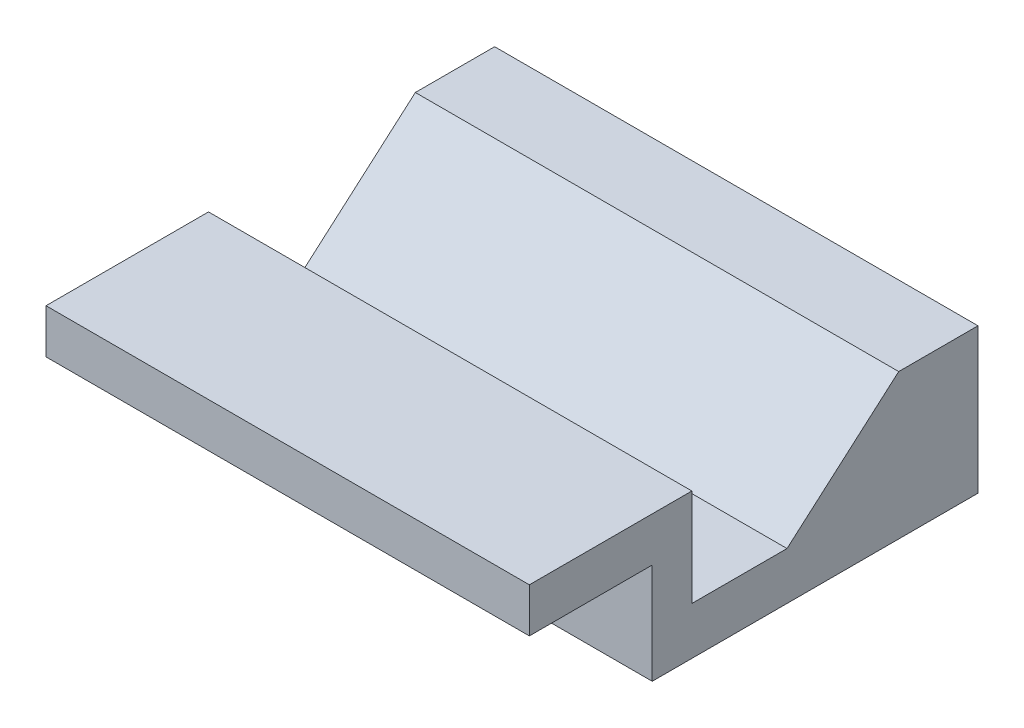
ISO-10303-21;
HEADER;
FILE_DESCRIPTION(('STEP AP214'),'2;1');
FILE_NAME('part.step','',(''),(''),'','','');
FILE_SCHEMA(('AUTOMOTIVE_DESIGN { 1 0 10303 214 1 1 1 1 }'));
ENDSEC;
DATA;
#1=APPLICATION_CONTEXT('core data for automotive mechanical design processes');
#2=APPLICATION_PROTOCOL_DEFINITION('international standard','automotive_design',2000,#1);
#3=PRODUCT_CONTEXT('',#1,'mechanical');
#4=PRODUCT('Part','Part','',(#3));
#5=PRODUCT_RELATED_PRODUCT_CATEGORY('part','',(#4));
#6=PRODUCT_DEFINITION_FORMATION('','',#4);
#7=PRODUCT_DEFINITION_CONTEXT('part definition',#1,'design');
#8=PRODUCT_DEFINITION('design','',#6,#7);
#9=PRODUCT_DEFINITION_SHAPE('','',#8);
#10=(LENGTH_UNIT() NAMED_UNIT(*) SI_UNIT(.MILLI.,.METRE.));
#11=(NAMED_UNIT(*) PLANE_ANGLE_UNIT() SI_UNIT($,.RADIAN.));
#12=(NAMED_UNIT(*) SI_UNIT($,.STERADIAN.) SOLID_ANGLE_UNIT());
#13=UNCERTAINTY_MEASURE_WITH_UNIT(LENGTH_MEASURE(1.E-05),#10,'distance_accuracy_value','');
#14=(GEOMETRIC_REPRESENTATION_CONTEXT(3) GLOBAL_UNCERTAINTY_ASSIGNED_CONTEXT((#13)) GLOBAL_UNIT_ASSIGNED_CONTEXT((#10,
#11,#12)) REPRESENTATION_CONTEXT('',''));
#15=CARTESIAN_POINT('',(0.,0.,0.));
#16=DIRECTION('',(0.,0.,1.));
#17=DIRECTION('',(1.,0.,0.));
#18=AXIS2_PLACEMENT_3D('',#15,#16,#17);
#19=CARTESIAN_POINT('',(30.48,0.,-10.247));
#20=DIRECTION('',(0.,0.,1.));
#21=DIRECTION('',(1.,0.,0.));
#22=AXIS2_PLACEMENT_3D('',#19,#20,#21);
#23=PLANE('',#22);
#24=DIRECTION('',(0.,1.,0.));
#25=VECTOR('',#24,1.);
#26=CARTESIAN_POINT('',(0.,0.,-10.247));
#27=LINE('',#26,#25);
#28=CARTESIAN_POINT('',(0.,-6.144,-10.247));
#29=VERTEX_POINT('',#28);
#30=CARTESIAN_POINT('',(0.,0.,-10.247));
#31=VERTEX_POINT('',#30);
#32=EDGE_CURVE('E141',#29,#31,#27,.T.);
#33=ORIENTED_EDGE('',*,*,#32,.T.);
#34=DIRECTION('',(-1.,0.,0.));
#35=VECTOR('',#34,1.);
#36=CARTESIAN_POINT('',(30.48,0.,-10.247));
#37=LINE('',#36,#35);
#38=CARTESIAN_POINT('',(30.48,0.,-10.247));
#39=VERTEX_POINT('',#38);
#40=EDGE_CURVE('E11',#39,#31,#37,.T.);
#41=ORIENTED_EDGE('',*,*,#40,.F.);
#42=DIRECTION('',(0.,1.,0.));
#43=VECTOR('',#42,1.);
#44=CARTESIAN_POINT('',(30.48,0.,-10.247));
#45=LINE('',#44,#43);
#46=CARTESIAN_POINT('',(30.48,-6.144,-10.247));
#47=VERTEX_POINT('',#46);
#48=EDGE_CURVE('E159',#47,#39,#45,.T.);
#49=ORIENTED_EDGE('',*,*,#48,.F.);
#50=DIRECTION('',(-1.,0.,0.));
#51=VECTOR('',#50,1.);
#52=CARTESIAN_POINT('',(30.48,-6.144,-10.247));
#53=LINE('',#52,#51);
#54=EDGE_CURVE('E137',#47,#29,#53,.T.);
#55=ORIENTED_EDGE('',*,*,#54,.T.);
#56=EDGE_LOOP('',(#33,#41,#49,#55));
#57=FACE_BOUND('',#56,.T.);
#58=ADVANCED_FACE('F33',(#57),#23,.F.);
#59=CARTESIAN_POINT('',(30.48,0.,0.));
#60=DIRECTION('',(0.,-1.,0.));
#61=DIRECTION('',(0.,0.,-1.));
#62=AXIS2_PLACEMENT_3D('',#59,#60,#61);
#63=PLANE('',#62);
#64=DIRECTION('',(0.,0.,1.));
#65=VECTOR('',#64,1.);
#66=CARTESIAN_POINT('',(0.,0.,0.));
#67=LINE('',#66,#65);
#68=CARTESIAN_POINT('',(0.,0.,0.));
#69=VERTEX_POINT('',#68);
#70=EDGE_CURVE('E144',#31,#69,#67,.T.);
#71=ORIENTED_EDGE('',*,*,#70,.T.);
#72=DIRECTION('',(-1.,0.,0.));
#73=VECTOR('',#72,1.);
#74=CARTESIAN_POINT('',(30.48,0.,0.));
#75=LINE('',#74,#73);
#76=CARTESIAN_POINT('',(30.48,0.,0.));
#77=VERTEX_POINT('',#76);
#78=EDGE_CURVE('E41',#77,#69,#75,.T.);
#79=ORIENTED_EDGE('',*,*,#78,.F.);
#80=DIRECTION('',(0.,0.,1.));
#81=VECTOR('',#80,1.);
#82=CARTESIAN_POINT('',(30.48,0.,0.));
#83=LINE('',#82,#81);
#84=EDGE_CURVE('E98',#39,#77,#83,.T.);
#85=ORIENTED_EDGE('',*,*,#84,.F.);
#86=ORIENTED_EDGE('',*,*,#40,.T.);
#87=EDGE_LOOP('',(#71,#79,#85,#86));
#88=FACE_BOUND('',#87,.T.);
#89=ADVANCED_FACE('F208',(#88),#63,.F.);
#90=CARTESIAN_POINT('',(30.48,0.,0.));
#91=DIRECTION('',(0.,0.,-1.));
#92=DIRECTION('',(0.,1.,0.));
#93=AXIS2_PLACEMENT_3D('',#90,#91,#92);
#94=PLANE('',#93);
#95=DIRECTION('',(0.,-1.,0.));
#96=VECTOR('',#95,1.);
#97=CARTESIAN_POINT('',(0.,0.,0.));
#98=LINE('',#97,#96);
#99=CARTESIAN_POINT('',(0.,-2.794,0.));
#100=VERTEX_POINT('',#99);
#101=EDGE_CURVE('E146',#69,#100,#98,.T.);
#102=ORIENTED_EDGE('',*,*,#101,.T.);
#103=DIRECTION('',(-1.,0.,0.));
#104=VECTOR('',#103,1.);
#105=CARTESIAN_POINT('',(30.48,-2.794,0.));
#106=LINE('',#105,#104);
#107=CARTESIAN_POINT('',(30.48,-2.794,0.));
#108=VERTEX_POINT('',#107);
#109=EDGE_CURVE('E172',#108,#100,#106,.T.);
#110=ORIENTED_EDGE('',*,*,#109,.F.);
#111=DIRECTION('',(0.,-1.,0.));
#112=VECTOR('',#111,1.);
#113=CARTESIAN_POINT('',(30.48,0.,0.));
#114=LINE('',#113,#112);
#115=EDGE_CURVE('E180',#77,#108,#114,.T.);
#116=ORIENTED_EDGE('',*,*,#115,.F.);
#117=ORIENTED_EDGE('',*,*,#78,.T.);
#118=EDGE_LOOP('',(#102,#110,#116,#117));
#119=FACE_BOUND('',#118,.T.);
#120=ADVANCED_FACE('F178',(#119),#94,.F.);
#121=CARTESIAN_POINT('',(30.48,-2.794,0.));
#122=DIRECTION('',(0.,1.,0.));
#123=DIRECTION('',(0.,0.,1.));
#124=AXIS2_PLACEMENT_3D('',#121,#122,#123);
#125=PLANE('',#124);
#126=DIRECTION('',(0.,0.,-1.));
#127=VECTOR('',#126,1.);
#128=CARTESIAN_POINT('',(0.,-2.794,0.));
#129=LINE('',#128,#127);
#130=CARTESIAN_POINT('',(0.,-2.794,-7.747));
#131=VERTEX_POINT('',#130);
#132=EDGE_CURVE('E148',#100,#131,#129,.T.);
#133=ORIENTED_EDGE('',*,*,#132,.T.);
#134=DIRECTION('',(-1.,0.,0.));
#135=VECTOR('',#134,1.);
#136=CARTESIAN_POINT('',(30.48,-2.794,-7.747));
#137=LINE('',#136,#135);
#138=CARTESIAN_POINT('',(30.48,-2.794,-7.747));
#139=VERTEX_POINT('',#138);
#140=EDGE_CURVE('E169',#139,#131,#137,.T.);
#141=ORIENTED_EDGE('',*,*,#140,.F.);
#142=DIRECTION('',(0.,0.,-1.));
#143=VECTOR('',#142,1.);
#144=CARTESIAN_POINT('',(30.48,-2.794,0.));
#145=LINE('',#144,#143);
#146=EDGE_CURVE('E198',#108,#139,#145,.T.);
#147=ORIENTED_EDGE('',*,*,#146,.F.);
#148=ORIENTED_EDGE('',*,*,#109,.T.);
#149=EDGE_LOOP('',(#133,#141,#147,#148));
#150=FACE_BOUND('',#149,.T.);
#151=ADVANCED_FACE('F189',(#150),#125,.F.);
#152=CARTESIAN_POINT('',(30.48,0.,-7.747));
#153=DIRECTION('',(0.,0.,-1.));
#154=DIRECTION('',(0.,1.,0.));
#155=AXIS2_PLACEMENT_3D('',#152,#153,#154);
#156=PLANE('',#155);
#157=DIRECTION('',(0.,-1.,0.));
#158=VECTOR('',#157,1.);
#159=CARTESIAN_POINT('',(0.,0.,-7.747));
#160=LINE('',#159,#158);
#161=CARTESIAN_POINT('',(0.,-9.144,-7.747));
#162=VERTEX_POINT('',#161);
#163=EDGE_CURVE('E150',#131,#162,#160,.T.);
#164=ORIENTED_EDGE('',*,*,#163,.T.);
#165=DIRECTION('',(-1.,0.,0.));
#166=VECTOR('',#165,1.);
#167=CARTESIAN_POINT('',(30.48,-9.144,-7.747));
#168=LINE('',#167,#166);
#169=CARTESIAN_POINT('',(30.48,-9.144,-7.747));
#170=VERTEX_POINT('',#169);
#171=EDGE_CURVE('E166',#170,#162,#168,.T.);
#172=ORIENTED_EDGE('',*,*,#171,.F.);
#173=DIRECTION('',(0.,-1.,0.));
#174=VECTOR('',#173,1.);
#175=CARTESIAN_POINT('',(30.48,0.,-7.747));
#176=LINE('',#175,#174);
#177=EDGE_CURVE('E195',#139,#170,#176,.T.);
#178=ORIENTED_EDGE('',*,*,#177,.F.);
#179=ORIENTED_EDGE('',*,*,#140,.T.);
#180=EDGE_LOOP('',(#164,#172,#178,#179));
#181=FACE_BOUND('',#180,.T.);
#182=ADVANCED_FACE('F193',(#181),#156,.F.);
#183=CARTESIAN_POINT('',(30.48,-9.144,0.));
#184=DIRECTION('',(0.,1.,0.));
#185=DIRECTION('',(0.,0.,1.));
#186=AXIS2_PLACEMENT_3D('',#183,#184,#185);
#187=PLANE('',#186);
#188=DIRECTION('',(0.,0.,-1.));
#189=VECTOR('',#188,1.);
#190=CARTESIAN_POINT('',(0.,-9.144,0.));
#191=LINE('',#190,#189);
#192=CARTESIAN_POINT('',(0.,-9.144,-28.29));
#193=VERTEX_POINT('',#192);
#194=EDGE_CURVE('E152',#162,#193,#191,.T.);
#195=ORIENTED_EDGE('',*,*,#194,.T.);
#196=DIRECTION('',(-1.,0.,0.));
#197=VECTOR('',#196,1.);
#198=CARTESIAN_POINT('',(30.48,-9.144,-28.29));
#199=LINE('',#198,#197);
#200=CARTESIAN_POINT('',(30.48,-9.144,-28.29));
#201=VERTEX_POINT('',#200);
#202=EDGE_CURVE('E163',#201,#193,#199,.T.);
#203=ORIENTED_EDGE('',*,*,#202,.F.);
#204=DIRECTION('',(0.,0.,-1.));
#205=VECTOR('',#204,1.);
#206=CARTESIAN_POINT('',(30.48,-9.144,0.));
#207=LINE('',#206,#205);
#208=EDGE_CURVE('E197',#170,#201,#207,.T.);
#209=ORIENTED_EDGE('',*,*,#208,.F.);
#210=ORIENTED_EDGE('',*,*,#171,.T.);
#211=EDGE_LOOP('',(#195,#203,#209,#210));
#212=FACE_BOUND('',#211,.T.);
#213=ADVANCED_FACE('F220',(#212),#187,.F.);
#214=CARTESIAN_POINT('',(30.48,0.,-28.29));
#215=DIRECTION('',(0.,0.,1.));
#216=DIRECTION('',(1.,0.,0.));
#217=AXIS2_PLACEMENT_3D('',#214,#215,#216);
#218=PLANE('',#217);
#219=DIRECTION('',(0.,1.,0.));
#220=VECTOR('',#219,1.);
#221=CARTESIAN_POINT('',(0.,0.,-28.29));
#222=LINE('',#221,#220);
#223=CARTESIAN_POINT('',(0.,0.,-28.29));
#224=VERTEX_POINT('',#223);
#225=EDGE_CURVE('E154',#193,#224,#222,.T.);
#226=ORIENTED_EDGE('',*,*,#225,.T.);
#227=DIRECTION('',(-1.,0.,0.));
#228=VECTOR('',#227,1.);
#229=CARTESIAN_POINT('',(30.48,0.,-28.29));
#230=LINE('',#229,#228);
#231=CARTESIAN_POINT('',(30.48,0.,-28.29));
#232=VERTEX_POINT('',#231);
#233=EDGE_CURVE('E132',#232,#224,#230,.T.);
#234=ORIENTED_EDGE('',*,*,#233,.F.);
#235=DIRECTION('',(0.,1.,0.));
#236=VECTOR('',#235,1.);
#237=CARTESIAN_POINT('',(30.48,0.,-28.29));
#238=LINE('',#237,#236);
#239=EDGE_CURVE('E123',#201,#232,#238,.T.);
#240=ORIENTED_EDGE('',*,*,#239,.F.);
#241=ORIENTED_EDGE('',*,*,#202,.T.);
#242=EDGE_LOOP('',(#226,#234,#240,#241));
#243=FACE_BOUND('',#242,.T.);
#244=ADVANCED_FACE('F223',(#243),#218,.F.);
#245=CARTESIAN_POINT('',(30.48,0.,0.));
#246=DIRECTION('',(0.,-1.,0.));
#247=DIRECTION('',(0.,0.,-1.));
#248=AXIS2_PLACEMENT_3D('',#245,#246,#247);
#249=PLANE('',#248);
#250=DIRECTION('',(0.,0.,1.));
#251=VECTOR('',#250,1.);
#252=CARTESIAN_POINT('',(0.,0.,0.));
#253=LINE('',#252,#251);
#254=CARTESIAN_POINT('',(0.,0.,-23.29));
#255=VERTEX_POINT('',#254);
#256=EDGE_CURVE('E131',#224,#255,#253,.T.);
#257=ORIENTED_EDGE('',*,*,#256,.T.);
#258=DIRECTION('',(-1.,0.,0.));
#259=VECTOR('',#258,1.);
#260=CARTESIAN_POINT('',(30.48,0.,-23.29));
#261=LINE('',#260,#259);
#262=CARTESIAN_POINT('',(30.48,0.,-23.29));
#263=VERTEX_POINT('',#262);
#264=EDGE_CURVE('E128',#263,#255,#261,.T.);
#265=ORIENTED_EDGE('',*,*,#264,.F.);
#266=DIRECTION('',(0.,0.,1.));
#267=VECTOR('',#266,1.);
#268=CARTESIAN_POINT('',(30.48,0.,0.));
#269=LINE('',#268,#267);
#270=EDGE_CURVE('E117',#232,#263,#269,.T.);
#271=ORIENTED_EDGE('',*,*,#270,.F.);
#272=ORIENTED_EDGE('',*,*,#233,.T.);
#273=EDGE_LOOP('',(#257,#265,#271,#272));
#274=FACE_BOUND('',#273,.T.);
#275=ADVANCED_FACE('F129',(#274),#249,.F.);
#276=CARTESIAN_POINT('',(30.48,-11.5372584758654,-10.0645912360808));
#277=DIRECTION('',(0.,-0.753563418594968,-0.657375215653484));
#278=DIRECTION('',(0.,0.657375215653484,-0.753563418594969));
#279=AXIS2_PLACEMENT_3D('',#276,#277,#278);
#280=PLANE('',#279);
#281=DIRECTION('',(0.,-0.657375215653484,0.753563418594969));
#282=VECTOR('',#281,1.);
#283=CARTESIAN_POINT('',(0.,-11.5372584758654,-10.0645912360808));
#284=LINE('',#283,#282);
#285=CARTESIAN_POINT('',(0.,-6.144,-16.247));
#286=VERTEX_POINT('',#285);
#287=EDGE_CURVE('E84',#255,#286,#284,.T.);
#288=ORIENTED_EDGE('',*,*,#287,.T.);
#289=DIRECTION('',(-1.,0.,0.));
#290=VECTOR('',#289,1.);
#291=CARTESIAN_POINT('',(30.48,-6.144,-16.247));
#292=LINE('',#291,#290);
#293=CARTESIAN_POINT('',(30.48,-6.144,-16.247));
#294=VERTEX_POINT('',#293);
#295=EDGE_CURVE('E133',#294,#286,#292,.T.);
#296=ORIENTED_EDGE('',*,*,#295,.F.);
#297=DIRECTION('',(0.,-0.657375215653484,0.753563418594969));
#298=VECTOR('',#297,1.);
#299=CARTESIAN_POINT('',(30.48,-11.5372584758654,-10.0645912360808));
#300=LINE('',#299,#298);
#301=EDGE_CURVE('E121',#263,#294,#300,.T.);
#302=ORIENTED_EDGE('',*,*,#301,.F.);
#303=ORIENTED_EDGE('',*,*,#264,.T.);
#304=EDGE_LOOP('',(#288,#296,#302,#303));
#305=FACE_BOUND('',#304,.T.);
#306=ADVANCED_FACE('F135',(#305),#280,.F.);
#307=CARTESIAN_POINT('',(30.48,-6.144,0.));
#308=DIRECTION('',(0.,-1.,0.));
#309=DIRECTION('',(0.,0.,-1.));
#310=AXIS2_PLACEMENT_3D('',#307,#308,#309);
#311=PLANE('',#310);
#312=DIRECTION('',(0.,0.,1.));
#313=VECTOR('',#312,1.);
#314=CARTESIAN_POINT('',(0.,-6.144,0.));
#315=LINE('',#314,#313);
#316=EDGE_CURVE('E90',#286,#29,#315,.T.);
#317=ORIENTED_EDGE('',*,*,#316,.T.);
#318=ORIENTED_EDGE('',*,*,#54,.F.);
#319=DIRECTION('',(0.,0.,1.));
#320=VECTOR('',#319,1.);
#321=CARTESIAN_POINT('',(30.48,-6.144,0.));
#322=LINE('',#321,#320);
#323=EDGE_CURVE('E49',#294,#47,#322,.T.);
#324=ORIENTED_EDGE('',*,*,#323,.F.);
#325=ORIENTED_EDGE('',*,*,#295,.T.);
#326=EDGE_LOOP('',(#317,#318,#324,#325));
#327=FACE_BOUND('',#326,.T.);
#328=ADVANCED_FACE('F232',(#327),#311,.F.);
#329=CARTESIAN_POINT('',(30.48,0.,0.));
#330=DIRECTION('',(1.,0.,0.));
#331=DIRECTION('',(0.,0.,-1.));
#332=AXIS2_PLACEMENT_3D('',#329,#330,#331);
#333=PLANE('',#332);
#334=ORIENTED_EDGE('',*,*,#48,.T.);
#335=ORIENTED_EDGE('',*,*,#84,.T.);
#336=ORIENTED_EDGE('',*,*,#115,.T.);
#337=ORIENTED_EDGE('',*,*,#146,.T.);
#338=ORIENTED_EDGE('',*,*,#177,.T.);
#339=ORIENTED_EDGE('',*,*,#208,.T.);
#340=ORIENTED_EDGE('',*,*,#239,.T.);
#341=ORIENTED_EDGE('',*,*,#270,.T.);
#342=ORIENTED_EDGE('',*,*,#301,.T.);
#343=ORIENTED_EDGE('',*,*,#323,.T.);
#344=EDGE_LOOP('',(#334,#335,#336,#337,#338,#339,#340,#341,#342,#343));
#345=FACE_BOUND('',#344,.T.);
#346=ADVANCED_FACE('F119',(#345),#333,.T.);
#347=CARTESIAN_POINT('',(0.,0.,0.));
#348=DIRECTION('',(1.,0.,0.));
#349=DIRECTION('',(0.,0.,-1.));
#350=AXIS2_PLACEMENT_3D('',#347,#348,#349);
#351=PLANE('',#350);
#352=ORIENTED_EDGE('',*,*,#32,.F.);
#353=ORIENTED_EDGE('',*,*,#316,.F.);
#354=ORIENTED_EDGE('',*,*,#287,.F.);
#355=ORIENTED_EDGE('',*,*,#256,.F.);
#356=ORIENTED_EDGE('',*,*,#225,.F.);
#357=ORIENTED_EDGE('',*,*,#194,.F.);
#358=ORIENTED_EDGE('',*,*,#163,.F.);
#359=ORIENTED_EDGE('',*,*,#132,.F.);
#360=ORIENTED_EDGE('',*,*,#101,.F.);
#361=ORIENTED_EDGE('',*,*,#70,.F.);
#362=EDGE_LOOP('',(#352,#353,#354,#355,#356,#357,#358,#359,#360,#361));
#363=FACE_BOUND('',#362,.T.);
#364=ADVANCED_FACE('F184',(#363),#351,.F.);
#365=CLOSED_SHELL('',(#58,#89,#120,#151,#182,#213,#244,#275,#306,#328,#346,#364));
#366=MANIFOLD_SOLID_BREP('B2',#365);
#367=ADVANCED_BREP_SHAPE_REPRESENTATION('',(#18,#366),#14);
#368=SHAPE_DEFINITION_REPRESENTATION(#9,#367);
ENDSEC;
END-ISO-10303-21;
